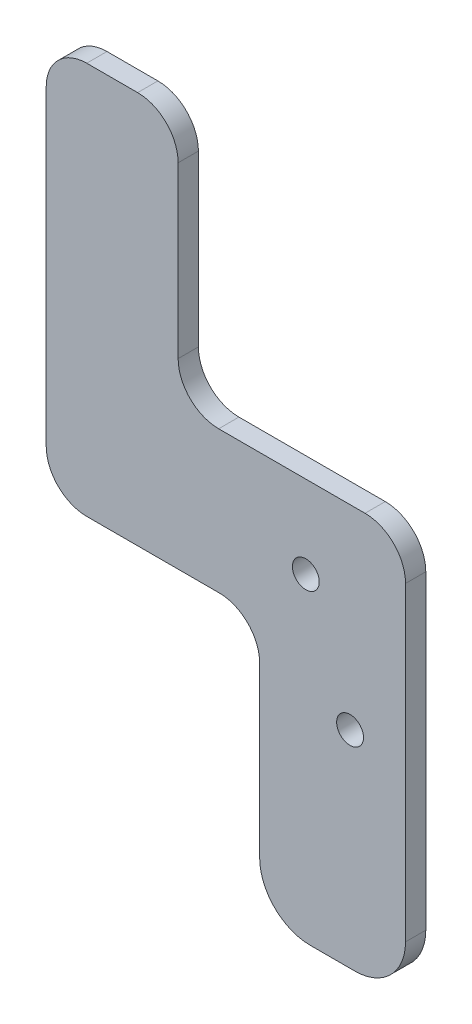
ISO-10303-21;
HEADER;
FILE_DESCRIPTION(('STEP AP214'),'2;1');
FILE_NAME('part.step','',(''),(''),'','','');
FILE_SCHEMA(('AUTOMOTIVE_DESIGN { 1 0 10303 214 1 1 1 1 }'));
ENDSEC;
DATA;
#1=APPLICATION_CONTEXT('core data for automotive mechanical design processes');
#2=APPLICATION_PROTOCOL_DEFINITION('international standard','automotive_design',2000,#1);
#3=PRODUCT_CONTEXT('',#1,'mechanical');
#4=PRODUCT('Part','Part','',(#3));
#5=PRODUCT_RELATED_PRODUCT_CATEGORY('part','',(#4));
#6=PRODUCT_DEFINITION_FORMATION('','',#4);
#7=PRODUCT_DEFINITION_CONTEXT('part definition',#1,'design');
#8=PRODUCT_DEFINITION('design','',#6,#7);
#9=PRODUCT_DEFINITION_SHAPE('','',#8);
#10=(LENGTH_UNIT() NAMED_UNIT(*) SI_UNIT(.MILLI.,.METRE.));
#11=(NAMED_UNIT(*) PLANE_ANGLE_UNIT() SI_UNIT($,.RADIAN.));
#12=(NAMED_UNIT(*) SI_UNIT($,.STERADIAN.) SOLID_ANGLE_UNIT());
#13=UNCERTAINTY_MEASURE_WITH_UNIT(LENGTH_MEASURE(1.E-05),#10,'distance_accuracy_value','');
#14=(GEOMETRIC_REPRESENTATION_CONTEXT(3) GLOBAL_UNCERTAINTY_ASSIGNED_CONTEXT((#13)) GLOBAL_UNIT_ASSIGNED_CONTEXT((#10,
#11,#12)) REPRESENTATION_CONTEXT('',''));
#15=CARTESIAN_POINT('',(0.,0.,0.));
#16=DIRECTION('',(0.,0.,1.));
#17=DIRECTION('',(1.,0.,0.));
#18=AXIS2_PLACEMENT_3D('',#15,#16,#17);
#19=CARTESIAN_POINT('',(-63.2759401965078,-253.855106797616,4.));
#20=DIRECTION('',(1.,0.,0.));
#21=DIRECTION('',(0.,0.,-1.));
#22=AXIS2_PLACEMENT_3D('',#19,#20,#21);
#23=PLANE('',#22);
#24=DIRECTION('',(0.,-1.,0.));
#25=VECTOR('',#24,1.);
#26=CARTESIAN_POINT('',(-63.2759401965078,-253.855106797616,4.));
#27=LINE('',#26,#25);
#28=CARTESIAN_POINT('',(-63.2759401965078,-341.655681156461,4.));
#29=VERTEX_POINT('',#28);
#30=CARTESIAN_POINT('',(-63.2759401965078,-374.933652969776,4.));
#31=VERTEX_POINT('',#30);
#32=EDGE_CURVE('E280',#29,#31,#27,.T.);
#33=ORIENTED_EDGE('',*,*,#32,.F.);
#34=DIRECTION('',(0.,0.,1.));
#35=VECTOR('',#34,1.);
#36=CARTESIAN_POINT('',(-63.2759401965078,-341.655681156461,4.));
#37=LINE('',#36,#35);
#38=CARTESIAN_POINT('',(-63.2759401965078,-341.655681156461,0.));
#39=VERTEX_POINT('',#38);
#40=EDGE_CURVE('E153',#29,#39,#37,.F.);
#41=ORIENTED_EDGE('',*,*,#40,.T.);
#42=DIRECTION('',(0.,-1.,0.));
#43=VECTOR('',#42,1.);
#44=CARTESIAN_POINT('',(-63.2759401965078,-253.855106797616,0.));
#45=LINE('',#44,#43);
#46=CARTESIAN_POINT('',(-63.2759401965078,-374.933652969776,0.));
#47=VERTEX_POINT('',#46);
#48=EDGE_CURVE('E146',#39,#47,#45,.T.);
#49=ORIENTED_EDGE('',*,*,#48,.T.);
#50=DIRECTION('',(0.,0.,-1.));
#51=VECTOR('',#50,1.);
#52=CARTESIAN_POINT('',(-63.2759401965078,-374.933652969776,4.));
#53=LINE('',#52,#51);
#54=EDGE_CURVE('E150',#47,#31,#53,.F.);
#55=ORIENTED_EDGE('',*,*,#54,.T.);
#56=EDGE_LOOP('',(#33,#41,#49,#55));
#57=FACE_BOUND('',#56,.T.);
#58=ADVANCED_FACE('F32',(#57),#23,.F.);
#59=CARTESIAN_POINT('',(-63.2759401965078,-384.933652969776,4.));
#60=DIRECTION('',(0.,1.,0.));
#61=DIRECTION('',(0.,0.,1.));
#62=AXIS2_PLACEMENT_3D('',#59,#60,#61);
#63=PLANE('',#62);
#64=DIRECTION('',(1.,0.,0.));
#65=VECTOR('',#64,1.);
#66=CARTESIAN_POINT('',(-63.2759401965078,-384.933652969776,4.));
#67=LINE('',#66,#65);
#68=CARTESIAN_POINT('',(-53.2759401965078,-384.933652969776,4.));
#69=VERTEX_POINT('',#68);
#70=CARTESIAN_POINT('',(-44.4730785631655,-384.933652969776,4.));
#71=VERTEX_POINT('',#70);
#72=EDGE_CURVE('E175',#69,#71,#67,.T.);
#73=ORIENTED_EDGE('',*,*,#72,.F.);
#74=DIRECTION('',(0.,0.,-1.));
#75=VECTOR('',#74,1.);
#76=CARTESIAN_POINT('',(-53.2759401965078,-384.933652969776,4.));
#77=LINE('',#76,#75);
#78=CARTESIAN_POINT('',(-53.2759401965078,-384.933652969776,0.));
#79=VERTEX_POINT('',#78);
#80=EDGE_CURVE('E188',#69,#79,#77,.T.);
#81=ORIENTED_EDGE('',*,*,#80,.T.);
#82=DIRECTION('',(1.,0.,0.));
#83=VECTOR('',#82,1.);
#84=CARTESIAN_POINT('',(-63.2759401965078,-384.933652969776,0.));
#85=LINE('',#84,#83);
#86=CARTESIAN_POINT('',(-44.4730785631655,-384.933652969776,0.));
#87=VERTEX_POINT('',#86);
#88=EDGE_CURVE('E155',#79,#87,#85,.T.);
#89=ORIENTED_EDGE('',*,*,#88,.T.);
#90=DIRECTION('',(0.,0.,-1.));
#91=VECTOR('',#90,1.);
#92=CARTESIAN_POINT('',(-44.4730785631655,-384.933652969776,4.));
#93=LINE('',#92,#91);
#94=EDGE_CURVE('E186',#87,#71,#93,.F.);
#95=ORIENTED_EDGE('',*,*,#94,.T.);
#96=EDGE_LOOP('',(#73,#81,#89,#95));
#97=FACE_BOUND('',#96,.T.);
#98=ADVANCED_FACE('F330',(#97),#63,.F.);
#99=CARTESIAN_POINT('',(-34.4730785631655,-253.855106797616,4.));
#100=DIRECTION('',(-1.,0.,0.));
#101=DIRECTION('',(0.,0.,1.));
#102=AXIS2_PLACEMENT_3D('',#99,#100,#101);
#103=PLANE('',#102);
#104=DIRECTION('',(0.,1.,0.));
#105=VECTOR('',#104,1.);
#106=CARTESIAN_POINT('',(-34.4730785631655,-253.855106797616,0.));
#107=LINE('',#106,#105);
#108=CARTESIAN_POINT('',(-34.4730785631655,-374.933652969776,0.));
#109=VERTEX_POINT('',#108);
#110=CARTESIAN_POINT('',(-34.4730785631655,-313.639740343613,0.));
#111=VERTEX_POINT('',#110);
#112=EDGE_CURVE('E178',#109,#111,#107,.T.);
#113=ORIENTED_EDGE('',*,*,#112,.T.);
#114=DIRECTION('',(0.,0.,1.));
#115=VECTOR('',#114,1.);
#116=CARTESIAN_POINT('',(-34.4730785631655,-313.639740343613,4.));
#117=LINE('',#116,#115);
#118=CARTESIAN_POINT('',(-34.4730785631655,-313.639740343613,4.));
#119=VERTEX_POINT('',#118);
#120=EDGE_CURVE('E230',#111,#119,#117,.T.);
#121=ORIENTED_EDGE('',*,*,#120,.T.);
#122=DIRECTION('',(0.,1.,0.));
#123=VECTOR('',#122,1.);
#124=CARTESIAN_POINT('',(-34.4730785631655,-253.855106797616,4.));
#125=LINE('',#124,#123);
#126=CARTESIAN_POINT('',(-34.4730785631655,-374.933652969776,4.));
#127=VERTEX_POINT('',#126);
#128=EDGE_CURVE('E171',#127,#119,#125,.T.);
#129=ORIENTED_EDGE('',*,*,#128,.F.);
#130=DIRECTION('',(0.,0.,-1.));
#131=VECTOR('',#130,1.);
#132=CARTESIAN_POINT('',(-34.4730785631655,-374.933652969776,4.));
#133=LINE('',#132,#131);
#134=EDGE_CURVE('E183',#127,#109,#133,.T.);
#135=ORIENTED_EDGE('',*,*,#134,.T.);
#136=EDGE_LOOP('',(#113,#121,#129,#135));
#137=FACE_BOUND('',#136,.T.);
#138=ADVANCED_FACE('F289',(#137),#103,.F.);
#139=CARTESIAN_POINT('',(0.,0.,4.));
#140=DIRECTION('',(0.,0.,1.));
#141=DIRECTION('',(1.,0.,0.));
#142=AXIS2_PLACEMENT_3D('',#139,#140,#141);
#143=PLANE('',#142);
#144=DIRECTION('',(0.,-1.,0.));
#145=VECTOR('',#144,1.);
#146=CARTESIAN_POINT('',(-105.42515080313,-333.655681156461,4.));
#147=LINE('',#146,#145);
#148=CARTESIAN_POINT('',(-105.42515080313,-264.153534459061,4.));
#149=VERTEX_POINT('',#148);
#150=CARTESIAN_POINT('',(-105.42515080313,-325.655681156461,4.));
#151=VERTEX_POINT('',#150);
#152=EDGE_CURVE('E297',#149,#151,#147,.T.);
#153=ORIENTED_EDGE('',*,*,#152,.T.);
#154=CARTESIAN_POINT('',(-97.4251508031296,-325.655681156461,4.));
#155=DIRECTION('',(0.,0.,1.));
#156=DIRECTION('',(1.,0.,0.));
#157=AXIS2_PLACEMENT_3D('',#154,#155,#156);
#158=CIRCLE('',#157,8.);
#159=CARTESIAN_POINT('',(-97.4251508031296,-333.655681156461,4.));
#160=VERTEX_POINT('',#159);
#161=EDGE_CURVE('E207',#151,#160,#158,.T.);
#162=ORIENTED_EDGE('',*,*,#161,.T.);
#163=DIRECTION('',(1.,0.,0.));
#164=VECTOR('',#163,1.);
#165=CARTESIAN_POINT('',(-63.2759401965078,-333.655681156461,4.));
#166=LINE('',#165,#164);
#167=CARTESIAN_POINT('',(-71.2759401965078,-333.655681156461,4.));
#168=VERTEX_POINT('',#167);
#169=EDGE_CURVE('E270',#160,#168,#166,.T.);
#170=ORIENTED_EDGE('',*,*,#169,.T.);
#171=CARTESIAN_POINT('',(-71.2759401965078,-341.655681156461,4.));
#172=DIRECTION('',(0.,0.,1.));
#173=DIRECTION('',(1.,0.,0.));
#174=AXIS2_PLACEMENT_3D('',#171,#172,#173);
#175=CIRCLE('',#174,8.);
#176=EDGE_CURVE('E233',#168,#29,#175,.F.);
#177=ORIENTED_EDGE('',*,*,#176,.T.);
#178=ORIENTED_EDGE('',*,*,#32,.T.);
#179=CARTESIAN_POINT('',(-53.2759401965078,-374.933652969776,4.));
#180=DIRECTION('',(0.,0.,1.));
#181=DIRECTION('',(1.,0.,0.));
#182=AXIS2_PLACEMENT_3D('',#179,#180,#181);
#183=CIRCLE('',#182,10.);
#184=EDGE_CURVE('E170',#31,#69,#183,.T.);
#185=ORIENTED_EDGE('',*,*,#184,.T.);
#186=ORIENTED_EDGE('',*,*,#72,.T.);
#187=CARTESIAN_POINT('',(-44.4730785631655,-374.933652969776,4.));
#188=DIRECTION('',(0.,0.,1.));
#189=DIRECTION('',(1.,0.,0.));
#190=AXIS2_PLACEMENT_3D('',#187,#188,#189);
#191=CIRCLE('',#190,10.);
#192=EDGE_CURVE('E166',#71,#127,#191,.T.);
#193=ORIENTED_EDGE('',*,*,#192,.T.);
#194=ORIENTED_EDGE('',*,*,#128,.T.);
#195=CARTESIAN_POINT('',(-42.4730785631655,-313.639740343613,4.));
#196=DIRECTION('',(0.,0.,1.));
#197=DIRECTION('',(1.,0.,0.));
#198=AXIS2_PLACEMENT_3D('',#195,#196,#197);
#199=CIRCLE('',#198,8.);
#200=CARTESIAN_POINT('',(-42.4730785631655,-305.639740343613,4.));
#201=VERTEX_POINT('',#200);
#202=EDGE_CURVE('E201',#119,#201,#199,.T.);
#203=ORIENTED_EDGE('',*,*,#202,.T.);
#204=DIRECTION('',(-1.,0.,0.));
#205=VECTOR('',#204,1.);
#206=CARTESIAN_POINT('',(-63.2759401965078,-305.639740343613,4.));
#207=LINE('',#206,#205);
#208=CARTESIAN_POINT('',(-71.3727061114773,-305.639740343613,4.));
#209=VERTEX_POINT('',#208);
#210=EDGE_CURVE('E244',#201,#209,#207,.T.);
#211=ORIENTED_EDGE('',*,*,#210,.T.);
#212=CARTESIAN_POINT('',(-71.3727061114773,-297.639740343613,4.));
#213=DIRECTION('',(0.,0.,1.));
#214=DIRECTION('',(1.,0.,0.));
#215=AXIS2_PLACEMENT_3D('',#212,#213,#214);
#216=CIRCLE('',#215,8.);
#217=CARTESIAN_POINT('',(-79.3727061114773,-297.639740343613,4.));
#218=VERTEX_POINT('',#217);
#219=EDGE_CURVE('E40',#209,#218,#216,.F.);
#220=ORIENTED_EDGE('',*,*,#219,.T.);
#221=DIRECTION('',(0.,1.,0.));
#222=VECTOR('',#221,1.);
#223=CARTESIAN_POINT('',(-79.3727061114773,-256.153534459061,4.));
#224=LINE('',#223,#222);
#225=CARTESIAN_POINT('',(-79.3727061114773,-264.153534459061,4.));
#226=VERTEX_POINT('',#225);
#227=EDGE_CURVE('E242',#218,#226,#224,.T.);
#228=ORIENTED_EDGE('',*,*,#227,.T.);
#229=CARTESIAN_POINT('',(-87.3727061114774,-264.153534459061,4.));
#230=DIRECTION('',(0.,0.,1.));
#231=DIRECTION('',(1.,0.,0.));
#232=AXIS2_PLACEMENT_3D('',#229,#230,#231);
#233=CIRCLE('',#232,8.);
#234=CARTESIAN_POINT('',(-87.3727061114774,-256.153534459061,4.));
#235=VERTEX_POINT('',#234);
#236=EDGE_CURVE('E203',#226,#235,#233,.T.);
#237=ORIENTED_EDGE('',*,*,#236,.T.);
#238=DIRECTION('',(-1.,0.,0.));
#239=VECTOR('',#238,1.);
#240=CARTESIAN_POINT('',(-79.3727061114773,-256.153534459061,4.));
#241=LINE('',#240,#239);
#242=CARTESIAN_POINT('',(-97.4251508031296,-256.153534459061,4.));
#243=VERTEX_POINT('',#242);
#244=EDGE_CURVE('E249',#235,#243,#241,.T.);
#245=ORIENTED_EDGE('',*,*,#244,.T.);
#246=CARTESIAN_POINT('',(-97.4251508031296,-264.153534459061,4.));
#247=DIRECTION('',(0.,0.,1.));
#248=DIRECTION('',(1.,0.,0.));
#249=AXIS2_PLACEMENT_3D('',#246,#247,#248);
#250=CIRCLE('',#249,8.);
#251=EDGE_CURVE('E205',#243,#149,#250,.T.);
#252=ORIENTED_EDGE('',*,*,#251,.T.);
#253=EDGE_LOOP('',(#153,#162,#170,#177,#178,#185,#186,#193,#194,#203,#211,#220,#228,#237,#245,#252));
#254=FACE_BOUND('',#253,.T.);
#255=CARTESIAN_POINT('',(-45.4264270076822,-344.165502046719,4.));
#256=DIRECTION('',(0.,0.,-1.));
#257=DIRECTION('',(-1.,0.,0.));
#258=AXIS2_PLACEMENT_3D('',#255,#256,#257);
#259=CIRCLE('',#258,2.64999999999999);
#260=CARTESIAN_POINT('',(-48.0764270076822,-344.165502046719,4.));
#261=VERTEX_POINT('',#260);
#262=EDGE_CURVE('E265',#261,#261,#259,.T.);
#263=ORIENTED_EDGE('',*,*,#262,.T.);
#264=EDGE_LOOP('',(#263));
#265=FACE_BOUND('',#264,.T.);
#266=CARTESIAN_POINT('',(-54.16270611,-321.91568115646,4.));
#267=DIRECTION('',(0.,0.,1.));
#268=DIRECTION('',(1.,0.,0.));
#269=AXIS2_PLACEMENT_3D('',#266,#267,#268);
#270=CIRCLE('',#269,2.65);
#271=CARTESIAN_POINT('',(-51.51270611,-321.91568115646,4.));
#272=VERTEX_POINT('',#271);
#273=EDGE_CURVE('E275',#272,#272,#270,.T.);
#274=ORIENTED_EDGE('',*,*,#273,.F.);
#275=EDGE_LOOP('',(#274));
#276=FACE_BOUND('',#275,.T.);
#277=ADVANCED_FACE('F240',(#254,#265,#276),#143,.T.);
#278=CARTESIAN_POINT('',(0.,0.,0.));
#279=DIRECTION('',(0.,0.,1.));
#280=DIRECTION('',(1.,0.,0.));
#281=AXIS2_PLACEMENT_3D('',#278,#279,#280);
#282=PLANE('',#281);
#283=CARTESIAN_POINT('',(-45.4264270076822,-344.165502046719,0.));
#284=DIRECTION('',(0.,0.,-1.));
#285=DIRECTION('',(-1.,0.,0.));
#286=AXIS2_PLACEMENT_3D('',#283,#284,#285);
#287=CIRCLE('',#286,2.64999999999999);
#288=CARTESIAN_POINT('',(-48.0764270076822,-344.165502046719,0.));
#289=VERTEX_POINT('',#288);
#290=EDGE_CURVE('E261',#289,#289,#287,.T.);
#291=ORIENTED_EDGE('',*,*,#290,.F.);
#292=EDGE_LOOP('',(#291));
#293=FACE_BOUND('',#292,.T.);
#294=CARTESIAN_POINT('',(-54.16270611,-321.91568115646,0.));
#295=DIRECTION('',(0.,0.,1.));
#296=DIRECTION('',(1.,0.,0.));
#297=AXIS2_PLACEMENT_3D('',#294,#295,#296);
#298=CIRCLE('',#297,2.65);
#299=CARTESIAN_POINT('',(-51.51270611,-321.91568115646,0.));
#300=VERTEX_POINT('',#299);
#301=EDGE_CURVE('E156',#300,#300,#298,.T.);
#302=ORIENTED_EDGE('',*,*,#301,.T.);
#303=EDGE_LOOP('',(#302));
#304=FACE_BOUND('',#303,.T.);
#305=DIRECTION('',(-1.,0.,0.));
#306=VECTOR('',#305,1.);
#307=CARTESIAN_POINT('',(-63.2759401965078,-333.655681156461,0.));
#308=LINE('',#307,#306);
#309=CARTESIAN_POINT('',(-71.2759401965078,-333.655681156461,0.));
#310=VERTEX_POINT('',#309);
#311=CARTESIAN_POINT('',(-97.4251508031296,-333.655681156461,0.));
#312=VERTEX_POINT('',#311);
#313=EDGE_CURVE('E262',#310,#312,#308,.T.);
#314=ORIENTED_EDGE('',*,*,#313,.T.);
#315=CARTESIAN_POINT('',(-97.4251508031296,-325.655681156461,0.));
#316=DIRECTION('',(0.,0.,1.));
#317=DIRECTION('',(1.,0.,0.));
#318=AXIS2_PLACEMENT_3D('',#315,#316,#317);
#319=CIRCLE('',#318,8.);
#320=CARTESIAN_POINT('',(-105.42515080313,-325.655681156461,0.));
#321=VERTEX_POINT('',#320);
#322=EDGE_CURVE('E214',#312,#321,#319,.F.);
#323=ORIENTED_EDGE('',*,*,#322,.T.);
#324=DIRECTION('',(0.,1.,0.));
#325=VECTOR('',#324,1.);
#326=CARTESIAN_POINT('',(-105.42515080313,-333.655681156461,0.));
#327=LINE('',#326,#325);
#328=CARTESIAN_POINT('',(-105.42515080313,-264.153534459061,0.));
#329=VERTEX_POINT('',#328);
#330=EDGE_CURVE('E267',#321,#329,#327,.T.);
#331=ORIENTED_EDGE('',*,*,#330,.T.);
#332=CARTESIAN_POINT('',(-97.4251508031296,-264.153534459061,0.));
#333=DIRECTION('',(0.,0.,1.));
#334=DIRECTION('',(1.,0.,0.));
#335=AXIS2_PLACEMENT_3D('',#332,#333,#334);
#336=CIRCLE('',#335,8.);
#337=CARTESIAN_POINT('',(-97.4251508031296,-256.153534459061,0.));
#338=VERTEX_POINT('',#337);
#339=EDGE_CURVE('E212',#329,#338,#336,.F.);
#340=ORIENTED_EDGE('',*,*,#339,.T.);
#341=DIRECTION('',(1.,0.,0.));
#342=VECTOR('',#341,1.);
#343=CARTESIAN_POINT('',(-79.3727061114773,-256.153534459061,0.));
#344=LINE('',#343,#342);
#345=CARTESIAN_POINT('',(-87.3727061114774,-256.153534459061,0.));
#346=VERTEX_POINT('',#345);
#347=EDGE_CURVE('E301',#338,#346,#344,.T.);
#348=ORIENTED_EDGE('',*,*,#347,.T.);
#349=CARTESIAN_POINT('',(-87.3727061114774,-264.153534459061,0.));
#350=DIRECTION('',(0.,0.,1.));
#351=DIRECTION('',(1.,0.,0.));
#352=AXIS2_PLACEMENT_3D('',#349,#350,#351);
#353=CIRCLE('',#352,8.);
#354=CARTESIAN_POINT('',(-79.3727061114773,-264.153534459061,0.));
#355=VERTEX_POINT('',#354);
#356=EDGE_CURVE('E54',#346,#355,#353,.F.);
#357=ORIENTED_EDGE('',*,*,#356,.T.);
#358=DIRECTION('',(0.,-1.,0.));
#359=VECTOR('',#358,1.);
#360=CARTESIAN_POINT('',(-79.3727061114773,-256.153534459061,0.));
#361=LINE('',#360,#359);
#362=CARTESIAN_POINT('',(-79.3727061114773,-297.639740343613,0.));
#363=VERTEX_POINT('',#362);
#364=EDGE_CURVE('E257',#355,#363,#361,.T.);
#365=ORIENTED_EDGE('',*,*,#364,.T.);
#366=CARTESIAN_POINT('',(-71.3727061114773,-297.639740343613,0.));
#367=DIRECTION('',(0.,0.,1.));
#368=DIRECTION('',(1.,0.,0.));
#369=AXIS2_PLACEMENT_3D('',#366,#367,#368);
#370=CIRCLE('',#369,8.);
#371=CARTESIAN_POINT('',(-71.3727061114773,-305.639740343613,0.));
#372=VERTEX_POINT('',#371);
#373=EDGE_CURVE('E11',#363,#372,#370,.T.);
#374=ORIENTED_EDGE('',*,*,#373,.T.);
#375=DIRECTION('',(1.,0.,0.));
#376=VECTOR('',#375,1.);
#377=CARTESIAN_POINT('',(-63.2759401965078,-305.639740343613,0.));
#378=LINE('',#377,#376);
#379=CARTESIAN_POINT('',(-42.4730785631655,-305.639740343613,0.));
#380=VERTEX_POINT('',#379);
#381=EDGE_CURVE('E255',#372,#380,#378,.T.);
#382=ORIENTED_EDGE('',*,*,#381,.T.);
#383=CARTESIAN_POINT('',(-42.4730785631655,-313.639740343613,0.));
#384=DIRECTION('',(0.,0.,1.));
#385=DIRECTION('',(1.,0.,0.));
#386=AXIS2_PLACEMENT_3D('',#383,#384,#385);
#387=CIRCLE('',#386,8.);
#388=EDGE_CURVE('E209',#380,#111,#387,.F.);
#389=ORIENTED_EDGE('',*,*,#388,.T.);
#390=ORIENTED_EDGE('',*,*,#112,.F.);
#391=CARTESIAN_POINT('',(-44.4730785631655,-374.933652969776,0.));
#392=DIRECTION('',(0.,0.,1.));
#393=DIRECTION('',(1.,0.,0.));
#394=AXIS2_PLACEMENT_3D('',#391,#392,#393);
#395=CIRCLE('',#394,10.);
#396=EDGE_CURVE('E167',#109,#87,#395,.F.);
#397=ORIENTED_EDGE('',*,*,#396,.T.);
#398=ORIENTED_EDGE('',*,*,#88,.F.);
#399=CARTESIAN_POINT('',(-53.2759401965078,-374.933652969776,0.));
#400=DIRECTION('',(0.,0.,1.));
#401=DIRECTION('',(1.,0.,0.));
#402=AXIS2_PLACEMENT_3D('',#399,#400,#401);
#403=CIRCLE('',#402,10.);
#404=EDGE_CURVE('E159',#79,#47,#403,.F.);
#405=ORIENTED_EDGE('',*,*,#404,.T.);
#406=ORIENTED_EDGE('',*,*,#48,.F.);
#407=CARTESIAN_POINT('',(-71.2759401965078,-341.655681156461,0.));
#408=DIRECTION('',(0.,0.,1.));
#409=DIRECTION('',(1.,0.,0.));
#410=AXIS2_PLACEMENT_3D('',#407,#408,#409);
#411=CIRCLE('',#410,8.);
#412=EDGE_CURVE('E235',#39,#310,#411,.T.);
#413=ORIENTED_EDGE('',*,*,#412,.T.);
#414=EDGE_LOOP('',(#314,#323,#331,#340,#348,#357,#365,#374,#382,#389,#390,#397,#398,#405,#406,#413));
#415=FACE_BOUND('',#414,.T.);
#416=ADVANCED_FACE('F161',(#293,#304,#415),#282,.F.);
#417=CARTESIAN_POINT('',(-54.16270611,-321.91568115646,4.));
#418=DIRECTION('',(0.,0.,1.));
#419=DIRECTION('',(1.,0.,0.));
#420=AXIS2_PLACEMENT_3D('',#417,#418,#419);
#421=CYLINDRICAL_SURFACE('',#420,2.65);
#422=ORIENTED_EDGE('',*,*,#301,.F.);
#423=EDGE_LOOP('',(#422));
#424=FACE_BOUND('',#423,.T.);
#425=ORIENTED_EDGE('',*,*,#273,.T.);
#426=EDGE_LOOP('',(#425));
#427=FACE_BOUND('',#426,.T.);
#428=ADVANCED_FACE('F341',(#424,#427),#421,.F.);
#429=CARTESIAN_POINT('',(-53.2759401965078,-374.933652969776,4.));
#430=DIRECTION('',(0.,0.,-1.));
#431=DIRECTION('',(-1.,0.,0.));
#432=AXIS2_PLACEMENT_3D('',#429,#430,#431);
#433=CYLINDRICAL_SURFACE('',#432,10.);
#434=ORIENTED_EDGE('',*,*,#184,.F.);
#435=ORIENTED_EDGE('',*,*,#54,.F.);
#436=ORIENTED_EDGE('',*,*,#404,.F.);
#437=ORIENTED_EDGE('',*,*,#80,.F.);
#438=EDGE_LOOP('',(#434,#435,#436,#437));
#439=FACE_BOUND('',#438,.T.);
#440=ADVANCED_FACE('F169',(#439),#433,.T.);
#441=CARTESIAN_POINT('',(-44.4730785631655,-374.933652969776,4.));
#442=DIRECTION('',(0.,0.,-1.));
#443=DIRECTION('',(-1.,0.,0.));
#444=AXIS2_PLACEMENT_3D('',#441,#442,#443);
#445=CYLINDRICAL_SURFACE('',#444,10.);
#446=ORIENTED_EDGE('',*,*,#192,.F.);
#447=ORIENTED_EDGE('',*,*,#94,.F.);
#448=ORIENTED_EDGE('',*,*,#396,.F.);
#449=ORIENTED_EDGE('',*,*,#134,.F.);
#450=EDGE_LOOP('',(#446,#447,#448,#449));
#451=FACE_BOUND('',#450,.T.);
#452=ADVANCED_FACE('F340',(#451),#445,.T.);
#453=CARTESIAN_POINT('',(-45.4264270076822,-344.165502046719,0.));
#454=DIRECTION('',(0.,0.,-1.));
#455=DIRECTION('',(-1.,0.,0.));
#456=AXIS2_PLACEMENT_3D('',#453,#454,#455);
#457=CYLINDRICAL_SURFACE('',#456,2.64999999999999);
#458=ORIENTED_EDGE('',*,*,#262,.F.);
#459=EDGE_LOOP('',(#458));
#460=FACE_BOUND('',#459,.T.);
#461=ORIENTED_EDGE('',*,*,#290,.T.);
#462=EDGE_LOOP('',(#461));
#463=FACE_BOUND('',#462,.T.);
#464=ADVANCED_FACE('F344',(#460,#463),#457,.F.);
#465=CARTESIAN_POINT('',(-63.2759401965078,-333.655681156461,-88.2220986911251));
#466=DIRECTION('',(0.,-1.,0.));
#467=DIRECTION('',(0.,0.,-1.));
#468=AXIS2_PLACEMENT_3D('',#465,#466,#467);
#469=PLANE('',#468);
#470=ORIENTED_EDGE('',*,*,#313,.F.);
#471=DIRECTION('',(0.,0.,1.));
#472=VECTOR('',#471,1.);
#473=CARTESIAN_POINT('',(-71.2759401965078,-333.655681156461,-88.2220986911251));
#474=LINE('',#473,#472);
#475=EDGE_CURVE('E192',#310,#168,#474,.T.);
#476=ORIENTED_EDGE('',*,*,#475,.T.);
#477=ORIENTED_EDGE('',*,*,#169,.F.);
#478=DIRECTION('',(0.,0.,1.));
#479=VECTOR('',#478,1.);
#480=CARTESIAN_POINT('',(-97.4251508031296,-333.655681156461,-88.2220986911251));
#481=LINE('',#480,#479);
#482=EDGE_CURVE('E190',#160,#312,#481,.F.);
#483=ORIENTED_EDGE('',*,*,#482,.T.);
#484=EDGE_LOOP('',(#470,#476,#477,#483));
#485=FACE_BOUND('',#484,.T.);
#486=ADVANCED_FACE('F357',(#485),#469,.T.);
#487=CARTESIAN_POINT('',(-105.42515080313,-333.655681156461,-88.2220986911251));
#488=DIRECTION('',(-1.,0.,0.));
#489=DIRECTION('',(0.,0.,1.));
#490=AXIS2_PLACEMENT_3D('',#487,#488,#489);
#491=PLANE('',#490);
#492=ORIENTED_EDGE('',*,*,#330,.F.);
#493=DIRECTION('',(0.,0.,1.));
#494=VECTOR('',#493,1.);
#495=CARTESIAN_POINT('',(-105.42515080313,-325.655681156461,-88.2220986911251));
#496=LINE('',#495,#494);
#497=EDGE_CURVE('E198',#321,#151,#496,.T.);
#498=ORIENTED_EDGE('',*,*,#497,.T.);
#499=ORIENTED_EDGE('',*,*,#152,.F.);
#500=DIRECTION('',(0.,0.,1.));
#501=VECTOR('',#500,1.);
#502=CARTESIAN_POINT('',(-105.42515080313,-264.153534459061,-88.2220986911251));
#503=LINE('',#502,#501);
#504=EDGE_CURVE('E196',#149,#329,#503,.F.);
#505=ORIENTED_EDGE('',*,*,#504,.T.);
#506=EDGE_LOOP('',(#492,#498,#499,#505));
#507=FACE_BOUND('',#506,.T.);
#508=ADVANCED_FACE('F355',(#507),#491,.T.);
#509=CARTESIAN_POINT('',(-79.3727061114773,-256.153534459061,-88.2220986911251));
#510=DIRECTION('',(0.,1.,0.));
#511=DIRECTION('',(0.,0.,1.));
#512=AXIS2_PLACEMENT_3D('',#509,#510,#511);
#513=PLANE('',#512);
#514=ORIENTED_EDGE('',*,*,#347,.F.);
#515=DIRECTION('',(0.,0.,1.));
#516=VECTOR('',#515,1.);
#517=CARTESIAN_POINT('',(-97.4251508031296,-256.153534459061,-88.2220986911251));
#518=LINE('',#517,#516);
#519=EDGE_CURVE('E218',#338,#243,#518,.T.);
#520=ORIENTED_EDGE('',*,*,#519,.T.);
#521=ORIENTED_EDGE('',*,*,#244,.F.);
#522=DIRECTION('',(0.,0.,1.));
#523=VECTOR('',#522,1.);
#524=CARTESIAN_POINT('',(-87.3727061114774,-256.153534459061,-88.2220986911251));
#525=LINE('',#524,#523);
#526=EDGE_CURVE('E216',#235,#346,#525,.F.);
#527=ORIENTED_EDGE('',*,*,#526,.T.);
#528=EDGE_LOOP('',(#514,#520,#521,#527));
#529=FACE_BOUND('',#528,.T.);
#530=ADVANCED_FACE('F317',(#529),#513,.T.);
#531=CARTESIAN_POINT('',(-79.3727061114773,-256.153534459061,-88.2220986911251));
#532=DIRECTION('',(1.,0.,0.));
#533=DIRECTION('',(0.,0.,-1.));
#534=AXIS2_PLACEMENT_3D('',#531,#532,#533);
#535=PLANE('',#534);
#536=ORIENTED_EDGE('',*,*,#364,.F.);
#537=DIRECTION('',(0.,0.,1.));
#538=VECTOR('',#537,1.);
#539=CARTESIAN_POINT('',(-79.3727061114773,-264.153534459061,-88.2220986911251));
#540=LINE('',#539,#538);
#541=EDGE_CURVE('E222',#355,#226,#540,.T.);
#542=ORIENTED_EDGE('',*,*,#541,.T.);
#543=ORIENTED_EDGE('',*,*,#227,.F.);
#544=DIRECTION('',(0.,0.,1.));
#545=VECTOR('',#544,1.);
#546=CARTESIAN_POINT('',(-79.3727061114773,-297.639740343613,0.));
#547=LINE('',#546,#545);
#548=EDGE_CURVE('E47',#218,#363,#547,.F.);
#549=ORIENTED_EDGE('',*,*,#548,.T.);
#550=EDGE_LOOP('',(#536,#542,#543,#549));
#551=FACE_BOUND('',#550,.T.);
#552=ADVANCED_FACE('F247',(#551),#535,.T.);
#553=CARTESIAN_POINT('',(-63.2759401965078,-305.639740343613,-88.2220986911251));
#554=DIRECTION('',(0.,1.,0.));
#555=DIRECTION('',(0.,0.,1.));
#556=AXIS2_PLACEMENT_3D('',#553,#554,#555);
#557=PLANE('',#556);
#558=ORIENTED_EDGE('',*,*,#381,.F.);
#559=DIRECTION('',(0.,0.,1.));
#560=VECTOR('',#559,1.);
#561=CARTESIAN_POINT('',(-71.3727061114773,-305.639740343613,4.));
#562=LINE('',#561,#560);
#563=EDGE_CURVE('E227',#372,#209,#562,.T.);
#564=ORIENTED_EDGE('',*,*,#563,.T.);
#565=ORIENTED_EDGE('',*,*,#210,.F.);
#566=DIRECTION('',(0.,0.,1.));
#567=VECTOR('',#566,1.);
#568=CARTESIAN_POINT('',(-42.4730785631655,-305.639740343613,0.));
#569=LINE('',#568,#567);
#570=EDGE_CURVE('E225',#201,#380,#569,.F.);
#571=ORIENTED_EDGE('',*,*,#570,.T.);
#572=EDGE_LOOP('',(#558,#564,#565,#571));
#573=FACE_BOUND('',#572,.T.);
#574=ADVANCED_FACE('F259',(#573),#557,.T.);
#575=CARTESIAN_POINT('',(-71.2759401965078,-341.655681156461,-88.2220986911251));
#576=DIRECTION('',(0.,0.,1.));
#577=DIRECTION('',(1.,0.,0.));
#578=AXIS2_PLACEMENT_3D('',#575,#576,#577);
#579=CYLINDRICAL_SURFACE('',#578,8.);
#580=ORIENTED_EDGE('',*,*,#412,.F.);
#581=ORIENTED_EDGE('',*,*,#40,.F.);
#582=ORIENTED_EDGE('',*,*,#176,.F.);
#583=ORIENTED_EDGE('',*,*,#475,.F.);
#584=EDGE_LOOP('',(#580,#581,#582,#583));
#585=FACE_BOUND('',#584,.T.);
#586=ADVANCED_FACE('F346',(#585),#579,.F.);
#587=CARTESIAN_POINT('',(-97.4251508031296,-325.655681156461,-88.2220986911251));
#588=DIRECTION('',(0.,0.,1.));
#589=DIRECTION('',(1.,0.,0.));
#590=AXIS2_PLACEMENT_3D('',#587,#588,#589);
#591=CYLINDRICAL_SURFACE('',#590,8.);
#592=ORIENTED_EDGE('',*,*,#322,.F.);
#593=ORIENTED_EDGE('',*,*,#482,.F.);
#594=ORIENTED_EDGE('',*,*,#161,.F.);
#595=ORIENTED_EDGE('',*,*,#497,.F.);
#596=EDGE_LOOP('',(#592,#593,#594,#595));
#597=FACE_BOUND('',#596,.T.);
#598=ADVANCED_FACE('F327',(#597),#591,.T.);
#599=CARTESIAN_POINT('',(-97.4251508031296,-264.153534459061,-88.2220986911251));
#600=DIRECTION('',(0.,0.,1.));
#601=DIRECTION('',(1.,0.,0.));
#602=AXIS2_PLACEMENT_3D('',#599,#600,#601);
#603=CYLINDRICAL_SURFACE('',#602,8.);
#604=ORIENTED_EDGE('',*,*,#339,.F.);
#605=ORIENTED_EDGE('',*,*,#504,.F.);
#606=ORIENTED_EDGE('',*,*,#251,.F.);
#607=ORIENTED_EDGE('',*,*,#519,.F.);
#608=EDGE_LOOP('',(#604,#605,#606,#607));
#609=FACE_BOUND('',#608,.T.);
#610=ADVANCED_FACE('F314',(#609),#603,.T.);
#611=CARTESIAN_POINT('',(-87.3727061114774,-264.153534459061,-88.2220986911251));
#612=DIRECTION('',(0.,0.,1.));
#613=DIRECTION('',(1.,0.,0.));
#614=AXIS2_PLACEMENT_3D('',#611,#612,#613);
#615=CYLINDRICAL_SURFACE('',#614,8.);
#616=ORIENTED_EDGE('',*,*,#356,.F.);
#617=ORIENTED_EDGE('',*,*,#526,.F.);
#618=ORIENTED_EDGE('',*,*,#236,.F.);
#619=ORIENTED_EDGE('',*,*,#541,.F.);
#620=EDGE_LOOP('',(#616,#617,#618,#619));
#621=FACE_BOUND('',#620,.T.);
#622=ADVANCED_FACE('F320',(#621),#615,.T.);
#623=CARTESIAN_POINT('',(-71.3727061114773,-297.639740343613,-88.2220986911251));
#624=DIRECTION('',(0.,0.,-1.));
#625=DIRECTION('',(-1.,0.,0.));
#626=AXIS2_PLACEMENT_3D('',#623,#624,#625);
#627=CYLINDRICAL_SURFACE('',#626,8.);
#628=ORIENTED_EDGE('',*,*,#373,.F.);
#629=ORIENTED_EDGE('',*,*,#548,.F.);
#630=ORIENTED_EDGE('',*,*,#219,.F.);
#631=ORIENTED_EDGE('',*,*,#563,.F.);
#632=EDGE_LOOP('',(#628,#629,#630,#631));
#633=FACE_BOUND('',#632,.T.);
#634=ADVANCED_FACE('F252',(#633),#627,.F.);
#635=CARTESIAN_POINT('',(-42.4730785631655,-313.639740343613,4.));
#636=DIRECTION('',(0.,0.,-1.));
#637=DIRECTION('',(-1.,0.,0.));
#638=AXIS2_PLACEMENT_3D('',#635,#636,#637);
#639=CYLINDRICAL_SURFACE('',#638,8.);
#640=ORIENTED_EDGE('',*,*,#388,.F.);
#641=ORIENTED_EDGE('',*,*,#570,.F.);
#642=ORIENTED_EDGE('',*,*,#202,.F.);
#643=ORIENTED_EDGE('',*,*,#120,.F.);
#644=EDGE_LOOP('',(#640,#641,#642,#643));
#645=FACE_BOUND('',#644,.T.);
#646=ADVANCED_FACE('F34',(#645),#639,.T.);
#647=CLOSED_SHELL('',(#58,#98,#138,#277,#416,#428,#440,#452,#464,#486,#508,#530,#552,#574,#586,
#598,#610,#622,#634,#646));
#648=MANIFOLD_SOLID_BREP('B2',#647);
#649=ADVANCED_BREP_SHAPE_REPRESENTATION('',(#18,#648),#14);
#650=SHAPE_DEFINITION_REPRESENTATION(#9,#649);
ENDSEC;
END-ISO-10303-21;
